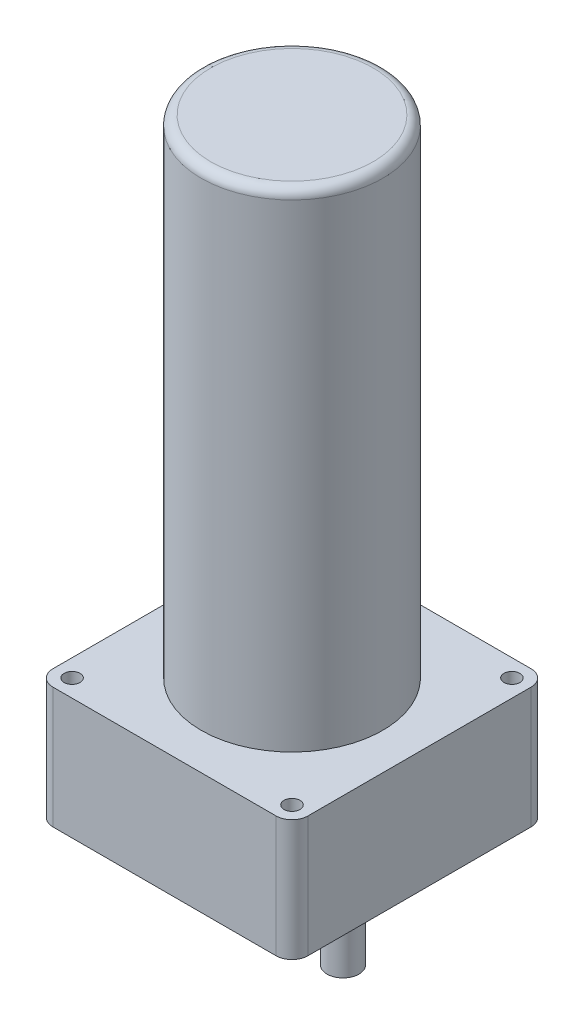
ISO-10303-21;
HEADER;
FILE_DESCRIPTION(('STEP AP214'),'2;1');
FILE_NAME('part.step','',(''),(''),'','','');
FILE_SCHEMA(('AUTOMOTIVE_DESIGN { 1 0 10303 214 1 1 1 1 }'));
ENDSEC;
DATA;
#1=APPLICATION_CONTEXT('core data for automotive mechanical design processes');
#2=APPLICATION_PROTOCOL_DEFINITION('international standard','automotive_design',2000,#1);
#3=PRODUCT_CONTEXT('',#1,'mechanical');
#4=PRODUCT('Part','Part','',(#3));
#5=PRODUCT_RELATED_PRODUCT_CATEGORY('part','',(#4));
#6=PRODUCT_DEFINITION_FORMATION('','',#4);
#7=PRODUCT_DEFINITION_CONTEXT('part definition',#1,'design');
#8=PRODUCT_DEFINITION('design','',#6,#7);
#9=PRODUCT_DEFINITION_SHAPE('','',#8);
#10=(LENGTH_UNIT() NAMED_UNIT(*) SI_UNIT(.MILLI.,.METRE.));
#11=(NAMED_UNIT(*) PLANE_ANGLE_UNIT() SI_UNIT($,.RADIAN.));
#12=(NAMED_UNIT(*) SI_UNIT($,.STERADIAN.) SOLID_ANGLE_UNIT());
#13=UNCERTAINTY_MEASURE_WITH_UNIT(LENGTH_MEASURE(1.E-05),#10,'distance_accuracy_value','');
#14=(GEOMETRIC_REPRESENTATION_CONTEXT(3) GLOBAL_UNCERTAINTY_ASSIGNED_CONTEXT((#13)) GLOBAL_UNIT_ASSIGNED_CONTEXT((#10,
#11,#12)) REPRESENTATION_CONTEXT('',''));
#15=CARTESIAN_POINT('',(0.,0.,0.));
#16=DIRECTION('',(0.,0.,1.));
#17=DIRECTION('',(1.,0.,0.));
#18=AXIS2_PLACEMENT_3D('',#15,#16,#17);
#19=CARTESIAN_POINT('',(40.,38.,40.));
#20=DIRECTION('',(-1.,0.,0.));
#21=DIRECTION('',(0.,0.,1.));
#22=AXIS2_PLACEMENT_3D('',#19,#20,#21);
#23=PLANE('',#22);
#24=DIRECTION('',(0.,0.,-1.));
#25=VECTOR('',#24,1.);
#26=CARTESIAN_POINT('',(40.,0.,40.));
#27=LINE('',#26,#25);
#28=CARTESIAN_POINT('',(40.,0.,35.));
#29=VERTEX_POINT('',#28);
#30=CARTESIAN_POINT('',(40.,0.,-35.));
#31=VERTEX_POINT('',#30);
#32=EDGE_CURVE('E134',#29,#31,#27,.T.);
#33=ORIENTED_EDGE('',*,*,#32,.T.);
#34=DIRECTION('',(0.,-1.,0.));
#35=VECTOR('',#34,1.);
#36=CARTESIAN_POINT('',(40.,38.,-35.));
#37=LINE('',#36,#35);
#38=CARTESIAN_POINT('',(40.,38.,-35.));
#39=VERTEX_POINT('',#38);
#40=EDGE_CURVE('E157',#31,#39,#37,.F.);
#41=ORIENTED_EDGE('',*,*,#40,.T.);
#42=DIRECTION('',(0.,0.,-1.));
#43=VECTOR('',#42,1.);
#44=CARTESIAN_POINT('',(40.,38.,40.));
#45=LINE('',#44,#43);
#46=CARTESIAN_POINT('',(40.,38.,35.));
#47=VERTEX_POINT('',#46);
#48=EDGE_CURVE('E132',#47,#39,#45,.T.);
#49=ORIENTED_EDGE('',*,*,#48,.F.);
#50=DIRECTION('',(0.,-1.,0.));
#51=VECTOR('',#50,1.);
#52=CARTESIAN_POINT('',(40.,38.,35.));
#53=LINE('',#52,#51);
#54=EDGE_CURVE('E154',#47,#29,#53,.T.);
#55=ORIENTED_EDGE('',*,*,#54,.T.);
#56=EDGE_LOOP('',(#33,#41,#49,#55));
#57=FACE_BOUND('',#56,.T.);
#58=ADVANCED_FACE('F37',(#57),#23,.F.);
#59=CARTESIAN_POINT('',(-40.,38.,-40.));
#60=DIRECTION('',(0.,0.,1.));
#61=DIRECTION('',(1.,0.,0.));
#62=AXIS2_PLACEMENT_3D('',#59,#60,#61);
#63=PLANE('',#62);
#64=DIRECTION('',(-1.,0.,0.));
#65=VECTOR('',#64,1.);
#66=CARTESIAN_POINT('',(-40.,0.,-40.));
#67=LINE('',#66,#65);
#68=CARTESIAN_POINT('',(35.,0.,-40.));
#69=VERTEX_POINT('',#68);
#70=CARTESIAN_POINT('',(-35.,0.,-40.));
#71=VERTEX_POINT('',#70);
#72=EDGE_CURVE('E130',#69,#71,#67,.T.);
#73=ORIENTED_EDGE('',*,*,#72,.T.);
#74=DIRECTION('',(0.,-1.,0.));
#75=VECTOR('',#74,1.);
#76=CARTESIAN_POINT('',(-35.,38.,-40.));
#77=LINE('',#76,#75);
#78=CARTESIAN_POINT('',(-35.,38.,-40.));
#79=VERTEX_POINT('',#78);
#80=EDGE_CURVE('E109',#71,#79,#77,.F.);
#81=ORIENTED_EDGE('',*,*,#80,.T.);
#82=DIRECTION('',(-1.,0.,0.));
#83=VECTOR('',#82,1.);
#84=CARTESIAN_POINT('',(-40.,38.,-40.));
#85=LINE('',#84,#83);
#86=CARTESIAN_POINT('',(35.,38.,-40.));
#87=VERTEX_POINT('',#86);
#88=EDGE_CURVE('E219',#87,#79,#85,.T.);
#89=ORIENTED_EDGE('',*,*,#88,.F.);
#90=DIRECTION('',(0.,-1.,0.));
#91=VECTOR('',#90,1.);
#92=CARTESIAN_POINT('',(35.,38.,-40.));
#93=LINE('',#92,#91);
#94=EDGE_CURVE('E114',#87,#69,#93,.T.);
#95=ORIENTED_EDGE('',*,*,#94,.T.);
#96=EDGE_LOOP('',(#73,#81,#89,#95));
#97=FACE_BOUND('',#96,.T.);
#98=ADVANCED_FACE('F178',(#97),#63,.F.);
#99=CARTESIAN_POINT('',(-40.,38.,40.));
#100=DIRECTION('',(1.,0.,0.));
#101=DIRECTION('',(0.,0.,-1.));
#102=AXIS2_PLACEMENT_3D('',#99,#100,#101);
#103=PLANE('',#102);
#104=DIRECTION('',(0.,0.,1.));
#105=VECTOR('',#104,1.);
#106=CARTESIAN_POINT('',(-40.,38.,40.));
#107=LINE('',#106,#105);
#108=CARTESIAN_POINT('',(-40.,38.,-35.));
#109=VERTEX_POINT('',#108);
#110=CARTESIAN_POINT('',(-40.,38.,35.));
#111=VERTEX_POINT('',#110);
#112=EDGE_CURVE('E123',#109,#111,#107,.T.);
#113=ORIENTED_EDGE('',*,*,#112,.F.);
#114=DIRECTION('',(0.,-1.,0.));
#115=VECTOR('',#114,1.);
#116=CARTESIAN_POINT('',(-40.,38.,-35.));
#117=LINE('',#116,#115);
#118=CARTESIAN_POINT('',(-40.,0.,-35.));
#119=VERTEX_POINT('',#118);
#120=EDGE_CURVE('E108',#109,#119,#117,.T.);
#121=ORIENTED_EDGE('',*,*,#120,.T.);
#122=DIRECTION('',(0.,0.,1.));
#123=VECTOR('',#122,1.);
#124=CARTESIAN_POINT('',(-40.,0.,40.));
#125=LINE('',#124,#123);
#126=CARTESIAN_POINT('',(-40.,0.,35.));
#127=VERTEX_POINT('',#126);
#128=EDGE_CURVE('E121',#119,#127,#125,.T.);
#129=ORIENTED_EDGE('',*,*,#128,.T.);
#130=DIRECTION('',(0.,-1.,0.));
#131=VECTOR('',#130,1.);
#132=CARTESIAN_POINT('',(-40.,38.,35.));
#133=LINE('',#132,#131);
#134=EDGE_CURVE('E125',#127,#111,#133,.F.);
#135=ORIENTED_EDGE('',*,*,#134,.T.);
#136=EDGE_LOOP('',(#113,#121,#129,#135));
#137=FACE_BOUND('',#136,.T.);
#138=ADVANCED_FACE('F120',(#137),#103,.F.);
#139=CARTESIAN_POINT('',(-40.,38.,40.));
#140=DIRECTION('',(0.,0.,-1.));
#141=DIRECTION('',(-1.,0.,0.));
#142=AXIS2_PLACEMENT_3D('',#139,#140,#141);
#143=PLANE('',#142);
#144=DIRECTION('',(1.,0.,0.));
#145=VECTOR('',#144,1.);
#146=CARTESIAN_POINT('',(-40.,0.,40.));
#147=LINE('',#146,#145);
#148=CARTESIAN_POINT('',(-35.,0.,40.));
#149=VERTEX_POINT('',#148);
#150=CARTESIAN_POINT('',(35.,0.,40.));
#151=VERTEX_POINT('',#150);
#152=EDGE_CURVE('E129',#149,#151,#147,.T.);
#153=ORIENTED_EDGE('',*,*,#152,.T.);
#154=DIRECTION('',(0.,-1.,0.));
#155=VECTOR('',#154,1.);
#156=CARTESIAN_POINT('',(35.,38.,40.));
#157=LINE('',#156,#155);
#158=CARTESIAN_POINT('',(35.,38.,40.));
#159=VERTEX_POINT('',#158);
#160=EDGE_CURVE('E52',#151,#159,#157,.F.);
#161=ORIENTED_EDGE('',*,*,#160,.T.);
#162=DIRECTION('',(1.,0.,0.));
#163=VECTOR('',#162,1.);
#164=CARTESIAN_POINT('',(-40.,38.,40.));
#165=LINE('',#164,#163);
#166=CARTESIAN_POINT('',(-35.,38.,40.));
#167=VERTEX_POINT('',#166);
#168=EDGE_CURVE('E211',#167,#159,#165,.T.);
#169=ORIENTED_EDGE('',*,*,#168,.F.);
#170=DIRECTION('',(0.,-1.,0.));
#171=VECTOR('',#170,1.);
#172=CARTESIAN_POINT('',(-35.,38.,40.));
#173=LINE('',#172,#171);
#174=EDGE_CURVE('E159',#167,#149,#173,.T.);
#175=ORIENTED_EDGE('',*,*,#174,.T.);
#176=EDGE_LOOP('',(#153,#161,#169,#175));
#177=FACE_BOUND('',#176,.T.);
#178=ADVANCED_FACE('F210',(#177),#143,.F.);
#179=CARTESIAN_POINT('',(0.,38.,0.));
#180=DIRECTION('',(0.,-1.,0.));
#181=DIRECTION('',(0.,0.,-1.));
#182=AXIS2_PLACEMENT_3D('',#179,#180,#181);
#183=PLANE('',#182);
#184=CARTESIAN_POINT('',(34.5,38.,34.5));
#185=DIRECTION('',(0.,-1.,0.));
#186=DIRECTION('',(0.,0.,-1.));
#187=AXIS2_PLACEMENT_3D('',#184,#185,#186);
#188=CIRCLE('',#187,2.5);
#189=CARTESIAN_POINT('',(34.5,38.,32.));
#190=VERTEX_POINT('',#189);
#191=EDGE_CURVE('E251',#190,#190,#188,.T.);
#192=ORIENTED_EDGE('',*,*,#191,.T.);
#193=EDGE_LOOP('',(#192));
#194=FACE_BOUND('',#193,.T.);
#195=CARTESIAN_POINT('',(34.5,38.,-34.5));
#196=DIRECTION('',(0.,-1.,0.));
#197=DIRECTION('',(0.,0.,-1.));
#198=AXIS2_PLACEMENT_3D('',#195,#196,#197);
#199=CIRCLE('',#198,2.5);
#200=CARTESIAN_POINT('',(34.5,38.,-37.));
#201=VERTEX_POINT('',#200);
#202=EDGE_CURVE('E263',#201,#201,#199,.T.);
#203=ORIENTED_EDGE('',*,*,#202,.T.);
#204=EDGE_LOOP('',(#203));
#205=FACE_BOUND('',#204,.T.);
#206=CARTESIAN_POINT('',(-34.5,38.,-34.5));
#207=DIRECTION('',(0.,-1.,0.));
#208=DIRECTION('',(0.,0.,-1.));
#209=AXIS2_PLACEMENT_3D('',#206,#207,#208);
#210=CIRCLE('',#209,2.5);
#211=CARTESIAN_POINT('',(-34.5,38.,-37.));
#212=VERTEX_POINT('',#211);
#213=EDGE_CURVE('E257',#212,#212,#210,.T.);
#214=ORIENTED_EDGE('',*,*,#213,.T.);
#215=EDGE_LOOP('',(#214));
#216=FACE_BOUND('',#215,.T.);
#217=CARTESIAN_POINT('',(-34.5,38.,34.5));
#218=DIRECTION('',(0.,-1.,0.));
#219=DIRECTION('',(0.,0.,-1.));
#220=AXIS2_PLACEMENT_3D('',#217,#218,#219);
#221=CIRCLE('',#220,2.5);
#222=CARTESIAN_POINT('',(-34.5,38.,32.));
#223=VERTEX_POINT('',#222);
#224=EDGE_CURVE('E247',#223,#223,#221,.T.);
#225=ORIENTED_EDGE('',*,*,#224,.T.);
#226=EDGE_LOOP('',(#225));
#227=FACE_BOUND('',#226,.T.);
#228=CARTESIAN_POINT('',(0.,38.,0.));
#229=DIRECTION('',(0.,1.,0.));
#230=DIRECTION('',(0.,0.,1.));
#231=AXIS2_PLACEMENT_3D('',#228,#229,#230);
#232=CIRCLE('',#231,28.5);
#233=CARTESIAN_POINT('',(0.,38.,28.5));
#234=VERTEX_POINT('',#233);
#235=EDGE_CURVE('E224',#234,#234,#232,.T.);
#236=ORIENTED_EDGE('',*,*,#235,.F.);
#237=EDGE_LOOP('',(#236));
#238=FACE_BOUND('',#237,.T.);
#239=ORIENTED_EDGE('',*,*,#88,.T.);
#240=CARTESIAN_POINT('',(-35.,38.,-35.));
#241=DIRECTION('',(0.,-1.,0.));
#242=DIRECTION('',(0.,0.,-1.));
#243=AXIS2_PLACEMENT_3D('',#240,#241,#242);
#244=CIRCLE('',#243,5.);
#245=EDGE_CURVE('E152',#79,#109,#244,.F.);
#246=ORIENTED_EDGE('',*,*,#245,.T.);
#247=ORIENTED_EDGE('',*,*,#112,.T.);
#248=CARTESIAN_POINT('',(-35.,38.,35.));
#249=DIRECTION('',(0.,-1.,0.));
#250=DIRECTION('',(0.,0.,-1.));
#251=AXIS2_PLACEMENT_3D('',#248,#249,#250);
#252=CIRCLE('',#251,5.);
#253=EDGE_CURVE('E59',#111,#167,#252,.F.);
#254=ORIENTED_EDGE('',*,*,#253,.T.);
#255=ORIENTED_EDGE('',*,*,#168,.T.);
#256=CARTESIAN_POINT('',(35.,38.,35.));
#257=DIRECTION('',(0.,-1.,0.));
#258=DIRECTION('',(0.,0.,-1.));
#259=AXIS2_PLACEMENT_3D('',#256,#257,#258);
#260=CIRCLE('',#259,5.);
#261=EDGE_CURVE('E148',#159,#47,#260,.F.);
#262=ORIENTED_EDGE('',*,*,#261,.T.);
#263=ORIENTED_EDGE('',*,*,#48,.T.);
#264=CARTESIAN_POINT('',(35.,38.,-35.));
#265=DIRECTION('',(0.,-1.,0.));
#266=DIRECTION('',(0.,0.,-1.));
#267=AXIS2_PLACEMENT_3D('',#264,#265,#266);
#268=CIRCLE('',#267,5.);
#269=EDGE_CURVE('E150',#39,#87,#268,.F.);
#270=ORIENTED_EDGE('',*,*,#269,.T.);
#271=EDGE_LOOP('',(#239,#246,#247,#254,#255,#262,#263,#270));
#272=FACE_BOUND('',#271,.T.);
#273=ADVANCED_FACE('F272',(#194,#205,#216,#227,#238,#272),#183,.F.);
#274=CARTESIAN_POINT('',(0.,0.,0.));
#275=DIRECTION('',(0.,-1.,0.));
#276=DIRECTION('',(0.,0.,-1.));
#277=AXIS2_PLACEMENT_3D('',#274,#275,#276);
#278=PLANE('',#277);
#279=CARTESIAN_POINT('',(34.5,0.,34.5));
#280=DIRECTION('',(0.,-1.,0.));
#281=DIRECTION('',(0.,0.,-1.));
#282=AXIS2_PLACEMENT_3D('',#279,#280,#281);
#283=CIRCLE('',#282,2.5);
#284=CARTESIAN_POINT('',(34.5,0.,32.));
#285=VERTEX_POINT('',#284);
#286=EDGE_CURVE('E266',#285,#285,#283,.T.);
#287=ORIENTED_EDGE('',*,*,#286,.F.);
#288=EDGE_LOOP('',(#287));
#289=FACE_BOUND('',#288,.T.);
#290=CARTESIAN_POINT('',(34.5,0.,-34.5));
#291=DIRECTION('',(0.,-1.,0.));
#292=DIRECTION('',(0.,0.,-1.));
#293=AXIS2_PLACEMENT_3D('',#290,#291,#292);
#294=CIRCLE('',#293,2.5);
#295=CARTESIAN_POINT('',(34.5,0.,-37.));
#296=VERTEX_POINT('',#295);
#297=EDGE_CURVE('E260',#296,#296,#294,.T.);
#298=ORIENTED_EDGE('',*,*,#297,.F.);
#299=EDGE_LOOP('',(#298));
#300=FACE_BOUND('',#299,.T.);
#301=CARTESIAN_POINT('',(-34.5,0.,-34.5));
#302=DIRECTION('',(0.,-1.,0.));
#303=DIRECTION('',(0.,0.,-1.));
#304=AXIS2_PLACEMENT_3D('',#301,#302,#303);
#305=CIRCLE('',#304,2.5);
#306=CARTESIAN_POINT('',(-34.5,0.,-37.));
#307=VERTEX_POINT('',#306);
#308=EDGE_CURVE('E254',#307,#307,#305,.T.);
#309=ORIENTED_EDGE('',*,*,#308,.F.);
#310=EDGE_LOOP('',(#309));
#311=FACE_BOUND('',#310,.T.);
#312=CARTESIAN_POINT('',(-34.5,0.,34.5));
#313=DIRECTION('',(0.,-1.,0.));
#314=DIRECTION('',(0.,0.,-1.));
#315=AXIS2_PLACEMENT_3D('',#312,#313,#314);
#316=CIRCLE('',#315,2.5);
#317=CARTESIAN_POINT('',(-34.5,0.,32.));
#318=VERTEX_POINT('',#317);
#319=EDGE_CURVE('E248',#318,#318,#316,.T.);
#320=ORIENTED_EDGE('',*,*,#319,.F.);
#321=EDGE_LOOP('',(#320));
#322=FACE_BOUND('',#321,.T.);
#323=CARTESIAN_POINT('',(0.,0.,0.));
#324=DIRECTION('',(0.,-1.,0.));
#325=DIRECTION('',(0.,0.,-1.));
#326=AXIS2_PLACEMENT_3D('',#323,#324,#325);
#327=CIRCLE('',#326,36.5);
#328=CARTESIAN_POINT('',(0.,0.,-36.5));
#329=VERTEX_POINT('',#328);
#330=EDGE_CURVE('E230',#329,#329,#327,.T.);
#331=ORIENTED_EDGE('',*,*,#330,.F.);
#332=EDGE_LOOP('',(#331));
#333=FACE_BOUND('',#332,.T.);
#334=ORIENTED_EDGE('',*,*,#128,.F.);
#335=CARTESIAN_POINT('',(-35.,0.,-35.));
#336=DIRECTION('',(0.,-1.,0.));
#337=DIRECTION('',(0.,0.,-1.));
#338=AXIS2_PLACEMENT_3D('',#335,#336,#337);
#339=CIRCLE('',#338,5.);
#340=EDGE_CURVE('E104',#119,#71,#339,.T.);
#341=ORIENTED_EDGE('',*,*,#340,.T.);
#342=ORIENTED_EDGE('',*,*,#72,.F.);
#343=CARTESIAN_POINT('',(35.,0.,-35.));
#344=DIRECTION('',(0.,-1.,0.));
#345=DIRECTION('',(0.,0.,-1.));
#346=AXIS2_PLACEMENT_3D('',#343,#344,#345);
#347=CIRCLE('',#346,5.);
#348=EDGE_CURVE('E115',#69,#31,#347,.T.);
#349=ORIENTED_EDGE('',*,*,#348,.T.);
#350=ORIENTED_EDGE('',*,*,#32,.F.);
#351=CARTESIAN_POINT('',(35.,0.,35.));
#352=DIRECTION('',(0.,-1.,0.));
#353=DIRECTION('',(0.,0.,-1.));
#354=AXIS2_PLACEMENT_3D('',#351,#352,#353);
#355=CIRCLE('',#354,5.);
#356=EDGE_CURVE('E141',#29,#151,#355,.T.);
#357=ORIENTED_EDGE('',*,*,#356,.T.);
#358=ORIENTED_EDGE('',*,*,#152,.F.);
#359=CARTESIAN_POINT('',(-35.,0.,35.));
#360=DIRECTION('',(0.,-1.,0.));
#361=DIRECTION('',(0.,0.,-1.));
#362=AXIS2_PLACEMENT_3D('',#359,#360,#361);
#363=CIRCLE('',#362,5.);
#364=EDGE_CURVE('E124',#149,#127,#363,.T.);
#365=ORIENTED_EDGE('',*,*,#364,.T.);
#366=EDGE_LOOP('',(#334,#341,#342,#349,#350,#357,#358,#365));
#367=FACE_BOUND('',#366,.T.);
#368=ADVANCED_FACE('F127',(#289,#300,#311,#322,#333,#367),#278,.T.);
#369=CARTESIAN_POINT('',(0.,191.,0.));
#370=DIRECTION('',(0.,-1.,0.));
#371=DIRECTION('',(0.,0.,-1.));
#372=AXIS2_PLACEMENT_3D('',#369,#370,#371);
#373=CYLINDRICAL_SURFACE('',#372,28.5);
#374=CARTESIAN_POINT('',(0.,188.,0.));
#375=DIRECTION('',(0.,1.,0.));
#376=DIRECTION('',(0.,0.,1.));
#377=AXIS2_PLACEMENT_3D('',#374,#375,#376);
#378=CIRCLE('',#377,28.5);
#379=CARTESIAN_POINT('',(0.,188.,28.5));
#380=VERTEX_POINT('',#379);
#381=EDGE_CURVE('E11',#380,#380,#378,.F.);
#382=ORIENTED_EDGE('',*,*,#381,.T.);
#383=EDGE_LOOP('',(#382));
#384=FACE_BOUND('',#383,.T.);
#385=ORIENTED_EDGE('',*,*,#235,.T.);
#386=EDGE_LOOP('',(#385));
#387=FACE_BOUND('',#386,.T.);
#388=ADVANCED_FACE('F279',(#384,#387),#373,.T.);
#389=CARTESIAN_POINT('',(0.,191.,0.));
#390=DIRECTION('',(0.,1.,0.));
#391=DIRECTION('',(0.,0.,1.));
#392=AXIS2_PLACEMENT_3D('',#389,#390,#391);
#393=PLANE('',#392);
#394=CARTESIAN_POINT('',(0.,191.,0.));
#395=DIRECTION('',(0.,1.,0.));
#396=DIRECTION('',(0.,0.,1.));
#397=AXIS2_PLACEMENT_3D('',#394,#395,#396);
#398=CIRCLE('',#397,25.5);
#399=CARTESIAN_POINT('',(0.,191.,25.5));
#400=VERTEX_POINT('',#399);
#401=EDGE_CURVE('E45',#400,#400,#398,.T.);
#402=ORIENTED_EDGE('',*,*,#401,.T.);
#403=EDGE_LOOP('',(#402));
#404=FACE_BOUND('',#403,.T.);
#405=ADVANCED_FACE('F165',(#404),#393,.T.);
#406=CARTESIAN_POINT('',(0.,1.,0.));
#407=DIRECTION('',(0.,-1.,0.));
#408=DIRECTION('',(0.,0.,-1.));
#409=AXIS2_PLACEMENT_3D('',#406,#407,#408);
#410=CYLINDRICAL_SURFACE('',#409,36.5);
#411=CARTESIAN_POINT('',(0.,1.,0.));
#412=DIRECTION('',(0.,-1.,0.));
#413=DIRECTION('',(0.,0.,-1.));
#414=AXIS2_PLACEMENT_3D('',#411,#412,#413);
#415=CIRCLE('',#414,36.5);
#416=CARTESIAN_POINT('',(0.,1.,-36.5));
#417=VERTEX_POINT('',#416);
#418=EDGE_CURVE('E228',#417,#417,#415,.T.);
#419=ORIENTED_EDGE('',*,*,#418,.F.);
#420=EDGE_LOOP('',(#419));
#421=FACE_BOUND('',#420,.T.);
#422=ORIENTED_EDGE('',*,*,#330,.T.);
#423=EDGE_LOOP('',(#422));
#424=FACE_BOUND('',#423,.T.);
#425=ADVANCED_FACE('F289',(#421,#424),#410,.F.);
#426=CARTESIAN_POINT('',(0.,1.,0.));
#427=DIRECTION('',(0.,-1.,0.));
#428=DIRECTION('',(0.,0.,-1.));
#429=AXIS2_PLACEMENT_3D('',#426,#427,#428);
#430=PLANE('',#429);
#431=CARTESIAN_POINT('',(16.,1.,0.));
#432=DIRECTION('',(0.,-1.,0.));
#433=DIRECTION('',(0.,0.,-1.));
#434=AXIS2_PLACEMENT_3D('',#431,#432,#433);
#435=CIRCLE('',#434,15.);
#436=CARTESIAN_POINT('',(16.,1.,-15.));
#437=VERTEX_POINT('',#436);
#438=EDGE_CURVE('E237',#437,#437,#435,.T.);
#439=ORIENTED_EDGE('',*,*,#438,.F.);
#440=EDGE_LOOP('',(#439));
#441=FACE_BOUND('',#440,.T.);
#442=ORIENTED_EDGE('',*,*,#418,.T.);
#443=EDGE_LOOP('',(#442));
#444=FACE_BOUND('',#443,.T.);
#445=ADVANCED_FACE('F291',(#441,#444),#430,.T.);
#446=CARTESIAN_POINT('',(16.,-3.,0.));
#447=DIRECTION('',(0.,1.,0.));
#448=DIRECTION('',(0.,0.,1.));
#449=AXIS2_PLACEMENT_3D('',#446,#447,#448);
#450=CYLINDRICAL_SURFACE('',#449,15.);
#451=CARTESIAN_POINT('',(16.,-3.,0.));
#452=DIRECTION('',(0.,-1.,0.));
#453=DIRECTION('',(0.,0.,-1.));
#454=AXIS2_PLACEMENT_3D('',#451,#452,#453);
#455=CIRCLE('',#454,15.);
#456=CARTESIAN_POINT('',(16.,-3.,-15.));
#457=VERTEX_POINT('',#456);
#458=EDGE_CURVE('E235',#457,#457,#455,.T.);
#459=ORIENTED_EDGE('',*,*,#458,.F.);
#460=EDGE_LOOP('',(#459));
#461=FACE_BOUND('',#460,.T.);
#462=ORIENTED_EDGE('',*,*,#438,.T.);
#463=EDGE_LOOP('',(#462));
#464=FACE_BOUND('',#463,.T.);
#465=ADVANCED_FACE('F298',(#461,#464),#450,.T.);
#466=CARTESIAN_POINT('',(16.,-3.,0.));
#467=DIRECTION('',(0.,-1.,0.));
#468=DIRECTION('',(0.,0.,-1.));
#469=AXIS2_PLACEMENT_3D('',#466,#467,#468);
#470=PLANE('',#469);
#471=CARTESIAN_POINT('',(16.,-3.,0.));
#472=DIRECTION('',(0.,-1.,0.));
#473=DIRECTION('',(0.,0.,-1.));
#474=AXIS2_PLACEMENT_3D('',#471,#472,#473);
#475=CIRCLE('',#474,5.);
#476=CARTESIAN_POINT('',(16.,-3.,-5.));
#477=VERTEX_POINT('',#476);
#478=EDGE_CURVE('E138',#477,#477,#475,.T.);
#479=ORIENTED_EDGE('',*,*,#478,.F.);
#480=EDGE_LOOP('',(#479));
#481=FACE_BOUND('',#480,.T.);
#482=ORIENTED_EDGE('',*,*,#458,.T.);
#483=EDGE_LOOP('',(#482));
#484=FACE_BOUND('',#483,.T.);
#485=ADVANCED_FACE('F406',(#481,#484),#470,.T.);
#486=CARTESIAN_POINT('',(16.,-32.,0.));
#487=DIRECTION('',(0.,1.,0.));
#488=DIRECTION('',(0.,0.,1.));
#489=AXIS2_PLACEMENT_3D('',#486,#487,#488);
#490=CYLINDRICAL_SURFACE('',#489,5.);
#491=CARTESIAN_POINT('',(16.,-32.,0.));
#492=DIRECTION('',(0.,-1.,0.));
#493=DIRECTION('',(0.,0.,-1.));
#494=AXIS2_PLACEMENT_3D('',#491,#492,#493);
#495=CIRCLE('',#494,5.);
#496=CARTESIAN_POINT('',(16.,-32.,-5.));
#497=VERTEX_POINT('',#496);
#498=EDGE_CURVE('E240',#497,#497,#495,.T.);
#499=ORIENTED_EDGE('',*,*,#498,.F.);
#500=EDGE_LOOP('',(#499));
#501=FACE_BOUND('',#500,.T.);
#502=ORIENTED_EDGE('',*,*,#478,.T.);
#503=EDGE_LOOP('',(#502));
#504=FACE_BOUND('',#503,.T.);
#505=ADVANCED_FACE('F397',(#501,#504),#490,.T.);
#506=CARTESIAN_POINT('',(16.,-32.,0.));
#507=DIRECTION('',(0.,-1.,0.));
#508=DIRECTION('',(0.,0.,-1.));
#509=AXIS2_PLACEMENT_3D('',#506,#507,#508);
#510=PLANE('',#509);
#511=ORIENTED_EDGE('',*,*,#498,.T.);
#512=EDGE_LOOP('',(#511));
#513=FACE_BOUND('',#512,.T.);
#514=ADVANCED_FACE('F192',(#513),#510,.T.);
#515=CARTESIAN_POINT('',(-35.,38.,-35.));
#516=DIRECTION('',(0.,-1.,0.));
#517=DIRECTION('',(0.,0.,-1.));
#518=AXIS2_PLACEMENT_3D('',#515,#516,#517);
#519=CYLINDRICAL_SURFACE('',#518,5.);
#520=ORIENTED_EDGE('',*,*,#245,.F.);
#521=ORIENTED_EDGE('',*,*,#80,.F.);
#522=ORIENTED_EDGE('',*,*,#340,.F.);
#523=ORIENTED_EDGE('',*,*,#120,.F.);
#524=EDGE_LOOP('',(#520,#521,#522,#523));
#525=FACE_BOUND('',#524,.T.);
#526=ADVANCED_FACE('F107',(#525),#519,.T.);
#527=CARTESIAN_POINT('',(35.,38.,-35.));
#528=DIRECTION('',(0.,-1.,0.));
#529=DIRECTION('',(0.,0.,-1.));
#530=AXIS2_PLACEMENT_3D('',#527,#528,#529);
#531=CYLINDRICAL_SURFACE('',#530,5.);
#532=ORIENTED_EDGE('',*,*,#269,.F.);
#533=ORIENTED_EDGE('',*,*,#40,.F.);
#534=ORIENTED_EDGE('',*,*,#348,.F.);
#535=ORIENTED_EDGE('',*,*,#94,.F.);
#536=EDGE_LOOP('',(#532,#533,#534,#535));
#537=FACE_BOUND('',#536,.T.);
#538=ADVANCED_FACE('F191',(#537),#531,.T.);
#539=CARTESIAN_POINT('',(35.,38.,35.));
#540=DIRECTION('',(0.,-1.,0.));
#541=DIRECTION('',(0.,0.,-1.));
#542=AXIS2_PLACEMENT_3D('',#539,#540,#541);
#543=CYLINDRICAL_SURFACE('',#542,5.);
#544=ORIENTED_EDGE('',*,*,#261,.F.);
#545=ORIENTED_EDGE('',*,*,#160,.F.);
#546=ORIENTED_EDGE('',*,*,#356,.F.);
#547=ORIENTED_EDGE('',*,*,#54,.F.);
#548=EDGE_LOOP('',(#544,#545,#546,#547));
#549=FACE_BOUND('',#548,.T.);
#550=ADVANCED_FACE('F195',(#549),#543,.T.);
#551=CARTESIAN_POINT('',(-35.,38.,35.));
#552=DIRECTION('',(0.,-1.,0.));
#553=DIRECTION('',(0.,0.,-1.));
#554=AXIS2_PLACEMENT_3D('',#551,#552,#553);
#555=CYLINDRICAL_SURFACE('',#554,5.);
#556=ORIENTED_EDGE('',*,*,#253,.F.);
#557=ORIENTED_EDGE('',*,*,#134,.F.);
#558=ORIENTED_EDGE('',*,*,#364,.F.);
#559=ORIENTED_EDGE('',*,*,#174,.F.);
#560=EDGE_LOOP('',(#556,#557,#558,#559));
#561=FACE_BOUND('',#560,.T.);
#562=ADVANCED_FACE('F198',(#561),#555,.T.);
#563=CARTESIAN_POINT('',(-34.5,38.,34.5));
#564=DIRECTION('',(0.,-1.,0.));
#565=DIRECTION('',(0.,0.,-1.));
#566=AXIS2_PLACEMENT_3D('',#563,#564,#565);
#567=CYLINDRICAL_SURFACE('',#566,2.5);
#568=ORIENTED_EDGE('',*,*,#224,.F.);
#569=EDGE_LOOP('',(#568));
#570=FACE_BOUND('',#569,.T.);
#571=ORIENTED_EDGE('',*,*,#319,.T.);
#572=EDGE_LOOP('',(#571));
#573=FACE_BOUND('',#572,.T.);
#574=ADVANCED_FACE('F201',(#570,#573),#567,.F.);
#575=CARTESIAN_POINT('',(-34.5,38.,-34.5));
#576=DIRECTION('',(0.,-1.,0.));
#577=DIRECTION('',(0.,0.,-1.));
#578=AXIS2_PLACEMENT_3D('',#575,#576,#577);
#579=CYLINDRICAL_SURFACE('',#578,2.5);
#580=ORIENTED_EDGE('',*,*,#213,.F.);
#581=EDGE_LOOP('',(#580));
#582=FACE_BOUND('',#581,.T.);
#583=ORIENTED_EDGE('',*,*,#308,.T.);
#584=EDGE_LOOP('',(#583));
#585=FACE_BOUND('',#584,.T.);
#586=ADVANCED_FACE('F206',(#582,#585),#579,.F.);
#587=CARTESIAN_POINT('',(34.5,38.,-34.5));
#588=DIRECTION('',(0.,-1.,0.));
#589=DIRECTION('',(0.,0.,-1.));
#590=AXIS2_PLACEMENT_3D('',#587,#588,#589);
#591=CYLINDRICAL_SURFACE('',#590,2.5);
#592=ORIENTED_EDGE('',*,*,#202,.F.);
#593=EDGE_LOOP('',(#592));
#594=FACE_BOUND('',#593,.T.);
#595=ORIENTED_EDGE('',*,*,#297,.T.);
#596=EDGE_LOOP('',(#595));
#597=FACE_BOUND('',#596,.T.);
#598=ADVANCED_FACE('F173',(#594,#597),#591,.F.);
#599=CARTESIAN_POINT('',(34.5,38.,34.5));
#600=DIRECTION('',(0.,-1.,0.));
#601=DIRECTION('',(0.,0.,-1.));
#602=AXIS2_PLACEMENT_3D('',#599,#600,#601);
#603=CYLINDRICAL_SURFACE('',#602,2.5);
#604=ORIENTED_EDGE('',*,*,#191,.F.);
#605=EDGE_LOOP('',(#604));
#606=FACE_BOUND('',#605,.T.);
#607=ORIENTED_EDGE('',*,*,#286,.T.);
#608=EDGE_LOOP('',(#607));
#609=FACE_BOUND('',#608,.T.);
#610=ADVANCED_FACE('F168',(#606,#609),#603,.F.);
#611=CARTESIAN_POINT('',(0.,188.,0.));
#612=DIRECTION('',(0.,1.,0.));
#613=DIRECTION('',(0.,0.,1.));
#614=AXIS2_PLACEMENT_3D('',#611,#612,#613);
#615=TOROIDAL_SURFACE('',#614,25.5,3.);
#616=ORIENTED_EDGE('',*,*,#381,.F.);
#617=EDGE_LOOP('',(#616));
#618=FACE_BOUND('',#617,.T.);
#619=ORIENTED_EDGE('',*,*,#401,.F.);
#620=EDGE_LOOP('',(#619));
#621=FACE_BOUND('',#620,.T.);
#622=ADVANCED_FACE('F39',(#618,#621),#615,.T.);
#623=CLOSED_SHELL('',(#58,#98,#138,#178,#273,#368,#388,#405,#425,#445,#465,#485,#505,#514,#526,
#538,#550,#562,#574,#586,#598,#610,#622));
#624=MANIFOLD_SOLID_BREP('B2',#623);
#625=ADVANCED_BREP_SHAPE_REPRESENTATION('',(#18,#624),#14);
#626=SHAPE_DEFINITION_REPRESENTATION(#9,#625);
ENDSEC;
END-ISO-10303-21;
